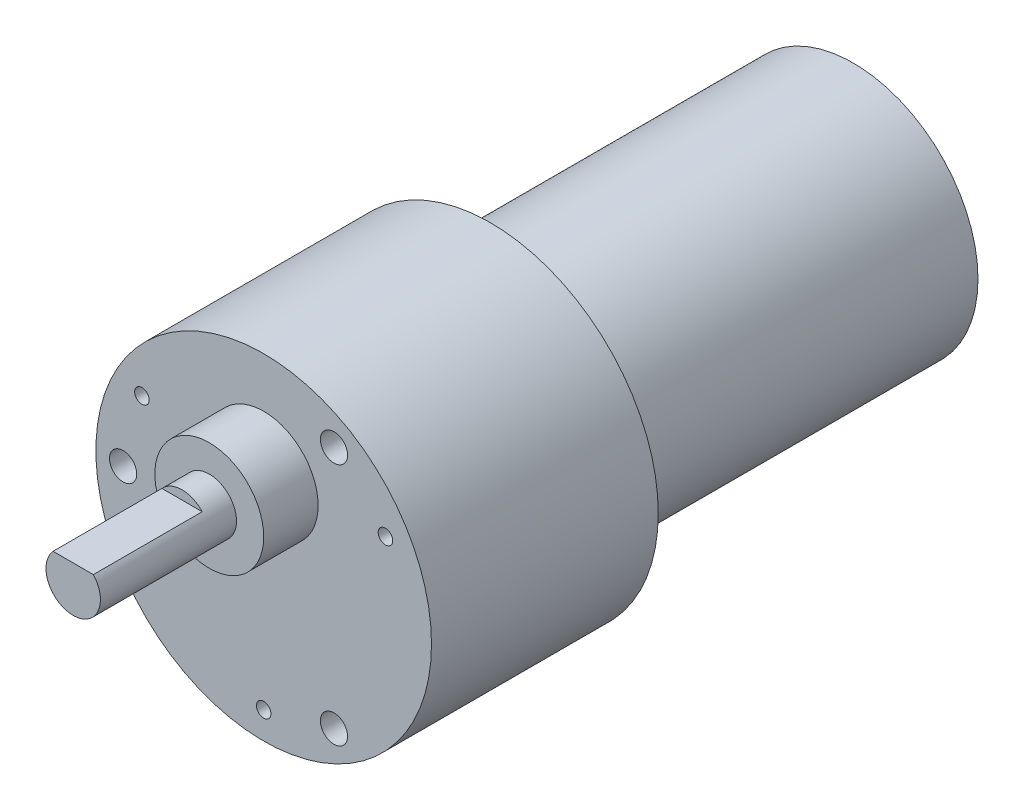
ISO-10303-21;
HEADER;
FILE_DESCRIPTION(('STEP AP214'),'2;1');
FILE_NAME('part.step','',(''),(''),'','','');
FILE_SCHEMA(('AUTOMOTIVE_DESIGN { 1 0 10303 214 1 1 1 1 }'));
ENDSEC;
DATA;
#1=APPLICATION_CONTEXT('core data for automotive mechanical design processes');
#2=APPLICATION_PROTOCOL_DEFINITION('international standard','automotive_design',2000,#1);
#3=PRODUCT_CONTEXT('',#1,'mechanical');
#4=PRODUCT('Part','Part','',(#3));
#5=PRODUCT_RELATED_PRODUCT_CATEGORY('part','',(#4));
#6=PRODUCT_DEFINITION_FORMATION('','',#4);
#7=PRODUCT_DEFINITION_CONTEXT('part definition',#1,'design');
#8=PRODUCT_DEFINITION('design','',#6,#7);
#9=PRODUCT_DEFINITION_SHAPE('','',#8);
#10=(LENGTH_UNIT() NAMED_UNIT(*) SI_UNIT(.MILLI.,.METRE.));
#11=(NAMED_UNIT(*) PLANE_ANGLE_UNIT() SI_UNIT($,.RADIAN.));
#12=(NAMED_UNIT(*) SI_UNIT($,.STERADIAN.) SOLID_ANGLE_UNIT());
#13=UNCERTAINTY_MEASURE_WITH_UNIT(LENGTH_MEASURE(1.E-05),#10,'distance_accuracy_value','');
#14=(GEOMETRIC_REPRESENTATION_CONTEXT(3) GLOBAL_UNCERTAINTY_ASSIGNED_CONTEXT((#13)) GLOBAL_UNIT_ASSIGNED_CONTEXT((#10,
#11,#12)) REPRESENTATION_CONTEXT('',''));
#15=CARTESIAN_POINT('',(0.,0.,0.));
#16=DIRECTION('',(0.,0.,1.));
#17=DIRECTION('',(1.,0.,0.));
#18=AXIS2_PLACEMENT_3D('',#15,#16,#17);
#19=CARTESIAN_POINT('',(0.,0.,0.));
#20=DIRECTION('',(0.,0.,1.));
#21=DIRECTION('',(1.,0.,0.));
#22=AXIS2_PLACEMENT_3D('',#19,#20,#21);
#23=PLANE('',#22);
#24=CARTESIAN_POINT('',(0.,0.,0.));
#25=DIRECTION('',(0.,0.,1.));
#26=DIRECTION('',(1.,0.,0.));
#27=AXIS2_PLACEMENT_3D('',#24,#25,#26);
#28=CIRCLE('',#27,13.75);
#29=CARTESIAN_POINT('',(13.75,0.,0.));
#30=VERTEX_POINT('',#29);
#31=EDGE_CURVE('E147',#30,#30,#28,.T.);
#32=ORIENTED_EDGE('',*,*,#31,.F.);
#33=EDGE_LOOP('',(#32));
#34=FACE_BOUND('',#33,.T.);
#35=CARTESIAN_POINT('',(0.,0.,0.));
#36=DIRECTION('',(0.,0.,1.));
#37=DIRECTION('',(1.,0.,0.));
#38=AXIS2_PLACEMENT_3D('',#35,#36,#37);
#39=CIRCLE('',#38,5.1);
#40=CARTESIAN_POINT('',(5.1,0.,0.));
#41=VERTEX_POINT('',#40);
#42=EDGE_CURVE('E11',#41,#41,#39,.F.);
#43=ORIENTED_EDGE('',*,*,#42,.F.);
#44=EDGE_LOOP('',(#43));
#45=FACE_BOUND('',#44,.T.);
#46=ADVANCED_FACE('F38',(#34,#45),#23,.F.);
#47=CARTESIAN_POINT('',(0.,7.,71.));
#48=DIRECTION('',(0.,0.,1.));
#49=DIRECTION('',(1.,0.,0.));
#50=AXIS2_PLACEMENT_3D('',#47,#48,#49);
#51=PLANE('',#50);
#52=CARTESIAN_POINT('',(0.,7.,71.));
#53=DIRECTION('',(0.,0.,1.));
#54=DIRECTION('',(1.,0.,0.));
#55=AXIS2_PLACEMENT_3D('',#52,#53,#54);
#56=CIRCLE('',#55,6.);
#57=CARTESIAN_POINT('',(6.,7.,71.));
#58=VERTEX_POINT('',#57);
#59=EDGE_CURVE('E138',#58,#58,#56,.T.);
#60=ORIENTED_EDGE('',*,*,#59,.T.);
#61=EDGE_LOOP('',(#60));
#62=FACE_BOUND('',#61,.T.);
#63=CARTESIAN_POINT('',(0.,7.,71.));
#64=DIRECTION('',(0.,0.,1.));
#65=DIRECTION('',(1.,0.,0.));
#66=AXIS2_PLACEMENT_3D('',#63,#64,#65);
#67=CIRCLE('',#66,3.);
#68=CARTESIAN_POINT('',(3.,7.,71.));
#69=VERTEX_POINT('',#68);
#70=EDGE_CURVE('E130',#69,#69,#67,.T.);
#71=ORIENTED_EDGE('',*,*,#70,.F.);
#72=EDGE_LOOP('',(#71));
#73=FACE_BOUND('',#72,.T.);
#74=ADVANCED_FACE('F180',(#62,#73),#51,.T.);
#75=CARTESIAN_POINT('',(0.,0.,65.));
#76=DIRECTION('',(0.,0.,1.));
#77=DIRECTION('',(1.,0.,0.));
#78=AXIS2_PLACEMENT_3D('',#75,#76,#77);
#79=PLANE('',#78);
#80=CARTESIAN_POINT('',(-13.4233937586588,7.75,65.));
#81=DIRECTION('',(0.,0.,1.));
#82=DIRECTION('',(1.,0.,0.));
#83=AXIS2_PLACEMENT_3D('',#80,#81,#82);
#84=CIRCLE('',#83,0.799999999999999);
#85=CARTESIAN_POINT('',(-12.6233937586588,7.75,65.));
#86=VERTEX_POINT('',#85);
#87=EDGE_CURVE('E87',#86,#86,#84,.T.);
#88=ORIENTED_EDGE('',*,*,#87,.F.);
#89=EDGE_LOOP('',(#88));
#90=FACE_BOUND('',#89,.T.);
#91=CARTESIAN_POINT('',(0.,-15.5,65.));
#92=DIRECTION('',(0.,0.,1.));
#93=DIRECTION('',(1.,0.,0.));
#94=AXIS2_PLACEMENT_3D('',#91,#92,#93);
#95=CIRCLE('',#94,0.799999999999999);
#96=CARTESIAN_POINT('',(0.799999999999999,-15.5,65.));
#97=VERTEX_POINT('',#96);
#98=EDGE_CURVE('E86',#97,#97,#95,.T.);
#99=ORIENTED_EDGE('',*,*,#98,.F.);
#100=EDGE_LOOP('',(#99));
#101=FACE_BOUND('',#100,.T.);
#102=CARTESIAN_POINT('',(13.4233937586588,7.75,65.));
#103=DIRECTION('',(0.,0.,1.));
#104=DIRECTION('',(1.,0.,0.));
#105=AXIS2_PLACEMENT_3D('',#102,#103,#104);
#106=CIRCLE('',#105,0.799999999999999);
#107=CARTESIAN_POINT('',(14.2233937586588,7.75,65.));
#108=VERTEX_POINT('',#107);
#109=EDGE_CURVE('E97',#108,#108,#106,.T.);
#110=ORIENTED_EDGE('',*,*,#109,.F.);
#111=EDGE_LOOP('',(#110));
#112=FACE_BOUND('',#111,.T.);
#113=CARTESIAN_POINT('',(7.75000000000006,13.4233937586588,65.));
#114=DIRECTION('',(0.,0.,1.));
#115=DIRECTION('',(1.,0.,0.));
#116=AXIS2_PLACEMENT_3D('',#113,#114,#115);
#117=CIRCLE('',#116,1.5);
#118=CARTESIAN_POINT('',(9.25000000000006,13.4233937586588,65.));
#119=VERTEX_POINT('',#118);
#120=EDGE_CURVE('E106',#119,#119,#117,.T.);
#121=ORIENTED_EDGE('',*,*,#120,.F.);
#122=EDGE_LOOP('',(#121));
#123=FACE_BOUND('',#122,.T.);
#124=CARTESIAN_POINT('',(7.75000000000007,-13.4233937586588,65.));
#125=DIRECTION('',(0.,0.,1.));
#126=DIRECTION('',(1.,0.,0.));
#127=AXIS2_PLACEMENT_3D('',#124,#125,#126);
#128=CIRCLE('',#127,1.5);
#129=CARTESIAN_POINT('',(9.25000000000007,-13.4233937586588,65.));
#130=VERTEX_POINT('',#129);
#131=EDGE_CURVE('E110',#130,#130,#128,.T.);
#132=ORIENTED_EDGE('',*,*,#131,.F.);
#133=EDGE_LOOP('',(#132));
#134=FACE_BOUND('',#133,.T.);
#135=CARTESIAN_POINT('',(-15.5,0.,65.));
#136=DIRECTION('',(0.,0.,1.));
#137=DIRECTION('',(1.,0.,0.));
#138=AXIS2_PLACEMENT_3D('',#135,#136,#137);
#139=CIRCLE('',#138,1.5);
#140=CARTESIAN_POINT('',(-14.,0.,65.));
#141=VERTEX_POINT('',#140);
#142=EDGE_CURVE('E116',#141,#141,#139,.T.);
#143=ORIENTED_EDGE('',*,*,#142,.F.);
#144=EDGE_LOOP('',(#143));
#145=FACE_BOUND('',#144,.T.);
#146=CARTESIAN_POINT('',(0.,0.,65.));
#147=DIRECTION('',(0.,0.,1.));
#148=DIRECTION('',(1.,0.,0.));
#149=AXIS2_PLACEMENT_3D('',#146,#147,#148);
#150=CIRCLE('',#149,18.5);
#151=CARTESIAN_POINT('',(18.5,0.,65.));
#152=VERTEX_POINT('',#151);
#153=EDGE_CURVE('E144',#152,#152,#150,.T.);
#154=ORIENTED_EDGE('',*,*,#153,.T.);
#155=EDGE_LOOP('',(#154));
#156=FACE_BOUND('',#155,.T.);
#157=CARTESIAN_POINT('',(0.,7.,65.));
#158=DIRECTION('',(0.,0.,1.));
#159=DIRECTION('',(1.,0.,0.));
#160=AXIS2_PLACEMENT_3D('',#157,#158,#159);
#161=CIRCLE('',#160,6.);
#162=CARTESIAN_POINT('',(6.,7.,65.));
#163=VERTEX_POINT('',#162);
#164=EDGE_CURVE('E135',#163,#163,#161,.T.);
#165=ORIENTED_EDGE('',*,*,#164,.F.);
#166=EDGE_LOOP('',(#165));
#167=FACE_BOUND('',#166,.T.);
#168=ADVANCED_FACE('F185',(#90,#101,#112,#123,#134,#145,#156,#167),#79,.T.);
#169=CARTESIAN_POINT('',(0.,0.,40.));
#170=DIRECTION('',(0.,0.,-1.));
#171=DIRECTION('',(-1.,0.,0.));
#172=AXIS2_PLACEMENT_3D('',#169,#170,#171);
#173=CYLINDRICAL_SURFACE('',#172,13.75);
#174=CARTESIAN_POINT('',(0.,0.,38.));
#175=DIRECTION('',(0.,0.,1.));
#176=DIRECTION('',(1.,0.,0.));
#177=AXIS2_PLACEMENT_3D('',#174,#175,#176);
#178=CIRCLE('',#177,13.75);
#179=CARTESIAN_POINT('',(13.75,0.,38.));
#180=VERTEX_POINT('',#179);
#181=EDGE_CURVE('E46',#180,#180,#178,.F.);
#182=ORIENTED_EDGE('',*,*,#181,.T.);
#183=EDGE_LOOP('',(#182));
#184=FACE_BOUND('',#183,.T.);
#185=ORIENTED_EDGE('',*,*,#31,.T.);
#186=EDGE_LOOP('',(#185));
#187=FACE_BOUND('',#186,.T.);
#188=ADVANCED_FACE('F157',(#184,#187),#173,.T.);
#189=CARTESIAN_POINT('',(0.,0.,40.));
#190=DIRECTION('',(0.,0.,1.));
#191=DIRECTION('',(1.,0.,0.));
#192=AXIS2_PLACEMENT_3D('',#189,#190,#191);
#193=PLANE('',#192);
#194=CARTESIAN_POINT('',(0.,0.,40.));
#195=DIRECTION('',(0.,0.,1.));
#196=DIRECTION('',(1.,0.,0.));
#197=AXIS2_PLACEMENT_3D('',#194,#195,#196);
#198=CIRCLE('',#197,15.75);
#199=CARTESIAN_POINT('',(15.75,0.,40.));
#200=VERTEX_POINT('',#199);
#201=EDGE_CURVE('E152',#200,#200,#198,.T.);
#202=ORIENTED_EDGE('',*,*,#201,.T.);
#203=EDGE_LOOP('',(#202));
#204=FACE_BOUND('',#203,.T.);
#205=CARTESIAN_POINT('',(0.,0.,40.));
#206=DIRECTION('',(0.,0.,1.));
#207=DIRECTION('',(1.,0.,0.));
#208=AXIS2_PLACEMENT_3D('',#205,#206,#207);
#209=CIRCLE('',#208,18.5);
#210=CARTESIAN_POINT('',(18.5,0.,40.));
#211=VERTEX_POINT('',#210);
#212=EDGE_CURVE('E141',#211,#211,#209,.T.);
#213=ORIENTED_EDGE('',*,*,#212,.F.);
#214=EDGE_LOOP('',(#213));
#215=FACE_BOUND('',#214,.T.);
#216=ADVANCED_FACE('F166',(#204,#215),#193,.F.);
#217=CARTESIAN_POINT('',(0.,0.,65.));
#218=DIRECTION('',(0.,0.,-1.));
#219=DIRECTION('',(-1.,0.,0.));
#220=AXIS2_PLACEMENT_3D('',#217,#218,#219);
#221=CYLINDRICAL_SURFACE('',#220,18.5);
#222=ORIENTED_EDGE('',*,*,#153,.F.);
#223=EDGE_LOOP('',(#222));
#224=FACE_BOUND('',#223,.T.);
#225=ORIENTED_EDGE('',*,*,#212,.T.);
#226=EDGE_LOOP('',(#225));
#227=FACE_BOUND('',#226,.T.);
#228=ADVANCED_FACE('F163',(#224,#227),#221,.T.);
#229=CARTESIAN_POINT('',(0.,0.,40.));
#230=DIRECTION('',(0.,0.,1.));
#231=DIRECTION('',(1.,0.,0.));
#232=AXIS2_PLACEMENT_3D('',#229,#230,#231);
#233=CONICAL_SURFACE('',#232,15.75,0.785398163397453);
#234=ORIENTED_EDGE('',*,*,#181,.F.);
#235=EDGE_LOOP('',(#234));
#236=FACE_BOUND('',#235,.T.);
#237=ORIENTED_EDGE('',*,*,#201,.F.);
#238=EDGE_LOOP('',(#237));
#239=FACE_BOUND('',#238,.T.);
#240=ADVANCED_FACE('F40',(#236,#239),#233,.T.);
#241=CARTESIAN_POINT('',(0.,7.,71.));
#242=DIRECTION('',(0.,0.,-1.));
#243=DIRECTION('',(-1.,0.,0.));
#244=AXIS2_PLACEMENT_3D('',#241,#242,#243);
#245=CYLINDRICAL_SURFACE('',#244,6.);
#246=ORIENTED_EDGE('',*,*,#59,.F.);
#247=EDGE_LOOP('',(#246));
#248=FACE_BOUND('',#247,.T.);
#249=ORIENTED_EDGE('',*,*,#164,.T.);
#250=EDGE_LOOP('',(#249));
#251=FACE_BOUND('',#250,.T.);
#252=ADVANCED_FACE('F162',(#248,#251),#245,.T.);
#253=CARTESIAN_POINT('',(0.,7.,86.));
#254=DIRECTION('',(0.,0.,-1.));
#255=DIRECTION('',(-1.,0.,0.));
#256=AXIS2_PLACEMENT_3D('',#253,#254,#255);
#257=CYLINDRICAL_SURFACE('',#256,3.);
#258=CARTESIAN_POINT('',(0.,7.,86.));
#259=DIRECTION('',(0.,0.,1.));
#260=DIRECTION('',(1.,0.,0.));
#261=AXIS2_PLACEMENT_3D('',#258,#259,#260);
#262=CIRCLE('',#261,3.);
#263=CARTESIAN_POINT('',(-2.22250964833451,9.01505604464491,86.));
#264=VERTEX_POINT('',#263);
#265=CARTESIAN_POINT('',(2.22250964833452,9.01505604464491,86.));
#266=VERTEX_POINT('',#265);
#267=EDGE_CURVE('E132',#264,#266,#262,.T.);
#268=ORIENTED_EDGE('',*,*,#267,.F.);
#269=DIRECTION('',(0.,0.,1.));
#270=VECTOR('',#269,1.);
#271=CARTESIAN_POINT('',(-2.22250964833451,9.01505604464491,74.));
#272=LINE('',#271,#270);
#273=CARTESIAN_POINT('',(-2.22250964833451,9.01505604464491,74.));
#274=VERTEX_POINT('',#273);
#275=EDGE_CURVE('E53',#274,#264,#272,.T.);
#276=ORIENTED_EDGE('',*,*,#275,.F.);
#277=CARTESIAN_POINT('',(0.,7.,74.));
#278=DIRECTION('',(0.,0.,1.));
#279=DIRECTION('',(1.,0.,0.));
#280=AXIS2_PLACEMENT_3D('',#277,#278,#279);
#281=CIRCLE('',#280,3.);
#282=CARTESIAN_POINT('',(2.22250964833452,9.01505604464491,74.));
#283=VERTEX_POINT('',#282);
#284=EDGE_CURVE('E124',#283,#274,#281,.T.);
#285=ORIENTED_EDGE('',*,*,#284,.F.);
#286=DIRECTION('',(0.,0.,1.));
#287=VECTOR('',#286,1.);
#288=CARTESIAN_POINT('',(2.22250964833452,9.01505604464491,74.));
#289=LINE('',#288,#287);
#290=EDGE_CURVE('E59',#283,#266,#289,.T.);
#291=ORIENTED_EDGE('',*,*,#290,.T.);
#292=EDGE_LOOP('',(#268,#276,#285,#291));
#293=FACE_BOUND('',#292,.T.);
#294=ORIENTED_EDGE('',*,*,#70,.T.);
#295=EDGE_LOOP('',(#294));
#296=FACE_BOUND('',#295,.T.);
#297=ADVANCED_FACE('F202',(#293,#296),#257,.T.);
#298=CARTESIAN_POINT('',(0.,7.,86.));
#299=DIRECTION('',(0.,0.,1.));
#300=DIRECTION('',(1.,0.,0.));
#301=AXIS2_PLACEMENT_3D('',#298,#299,#300);
#302=PLANE('',#301);
#303=DIRECTION('',(1.,0.,0.));
#304=VECTOR('',#303,1.);
#305=CARTESIAN_POINT('',(-2.22250964833451,9.01505604464491,86.));
#306=LINE('',#305,#304);
#307=EDGE_CURVE('E66',#264,#266,#306,.T.);
#308=ORIENTED_EDGE('',*,*,#307,.F.);
#309=ORIENTED_EDGE('',*,*,#267,.T.);
#310=EDGE_LOOP('',(#308,#309));
#311=FACE_BOUND('',#310,.T.);
#312=ADVANCED_FACE('F207',(#311),#302,.T.);
#313=CARTESIAN_POINT('',(-2.22250964833451,9.01505604464491,74.));
#314=DIRECTION('',(0.,-1.,0.));
#315=DIRECTION('',(1.,0.,0.));
#316=AXIS2_PLACEMENT_3D('',#313,#314,#315);
#317=PLANE('',#316);
#318=ORIENTED_EDGE('',*,*,#307,.T.);
#319=ORIENTED_EDGE('',*,*,#290,.F.);
#320=DIRECTION('',(1.,0.,0.));
#321=VECTOR('',#320,1.);
#322=CARTESIAN_POINT('',(-2.22250964833451,9.01505604464491,74.));
#323=LINE('',#322,#321);
#324=EDGE_CURVE('E126',#274,#283,#323,.T.);
#325=ORIENTED_EDGE('',*,*,#324,.F.);
#326=ORIENTED_EDGE('',*,*,#275,.T.);
#327=EDGE_LOOP('',(#318,#319,#325,#326));
#328=FACE_BOUND('',#327,.T.);
#329=ADVANCED_FACE('F211',(#328),#317,.F.);
#330=CARTESIAN_POINT('',(0.,7.,74.));
#331=DIRECTION('',(0.,0.,1.));
#332=DIRECTION('',(1.,0.,0.));
#333=AXIS2_PLACEMENT_3D('',#330,#331,#332);
#334=PLANE('',#333);
#335=ORIENTED_EDGE('',*,*,#284,.T.);
#336=ORIENTED_EDGE('',*,*,#324,.T.);
#337=EDGE_LOOP('',(#335,#336));
#338=FACE_BOUND('',#337,.T.);
#339=ADVANCED_FACE('F215',(#338),#334,.T.);
#340=CARTESIAN_POINT('',(-15.5,0.,59.));
#341=DIRECTION('',(0.,0.,1.));
#342=DIRECTION('',(1.,0.,0.));
#343=AXIS2_PLACEMENT_3D('',#340,#341,#342);
#344=CYLINDRICAL_SURFACE('',#343,1.5);
#345=CARTESIAN_POINT('',(-15.5,0.,59.));
#346=DIRECTION('',(0.,0.,1.));
#347=DIRECTION('',(1.,0.,0.));
#348=AXIS2_PLACEMENT_3D('',#345,#346,#347);
#349=CIRCLE('',#348,1.5);
#350=CARTESIAN_POINT('',(-14.,0.,59.));
#351=VERTEX_POINT('',#350);
#352=EDGE_CURVE('E119',#351,#351,#349,.T.);
#353=ORIENTED_EDGE('',*,*,#352,.F.);
#354=EDGE_LOOP('',(#353));
#355=FACE_BOUND('',#354,.T.);
#356=ORIENTED_EDGE('',*,*,#142,.T.);
#357=EDGE_LOOP('',(#356));
#358=FACE_BOUND('',#357,.T.);
#359=ADVANCED_FACE('F218',(#355,#358),#344,.F.);
#360=CARTESIAN_POINT('',(-15.5,0.,59.));
#361=DIRECTION('',(0.,0.,1.));
#362=DIRECTION('',(1.,0.,0.));
#363=AXIS2_PLACEMENT_3D('',#360,#361,#362);
#364=PLANE('',#363);
#365=ORIENTED_EDGE('',*,*,#352,.T.);
#366=EDGE_LOOP('',(#365));
#367=FACE_BOUND('',#366,.T.);
#368=ADVANCED_FACE('F222',(#367),#364,.T.);
#369=CARTESIAN_POINT('',(7.75000000000007,-13.4233937586588,59.));
#370=DIRECTION('',(0.,0.,1.));
#371=DIRECTION('',(1.,0.,0.));
#372=AXIS2_PLACEMENT_3D('',#369,#370,#371);
#373=CYLINDRICAL_SURFACE('',#372,1.5);
#374=CARTESIAN_POINT('',(7.75000000000007,-13.4233937586588,59.));
#375=DIRECTION('',(0.,0.,1.));
#376=DIRECTION('',(1.,0.,0.));
#377=AXIS2_PLACEMENT_3D('',#374,#375,#376);
#378=CIRCLE('',#377,1.5);
#379=CARTESIAN_POINT('',(9.25000000000007,-13.4233937586588,59.));
#380=VERTEX_POINT('',#379);
#381=EDGE_CURVE('E113',#380,#380,#378,.T.);
#382=ORIENTED_EDGE('',*,*,#381,.F.);
#383=EDGE_LOOP('',(#382));
#384=FACE_BOUND('',#383,.T.);
#385=ORIENTED_EDGE('',*,*,#131,.T.);
#386=EDGE_LOOP('',(#385));
#387=FACE_BOUND('',#386,.T.);
#388=ADVANCED_FACE('F226',(#384,#387),#373,.F.);
#389=CARTESIAN_POINT('',(7.75000000000007,-13.4233937586588,59.));
#390=DIRECTION('',(0.,0.,1.));
#391=DIRECTION('',(1.,0.,0.));
#392=AXIS2_PLACEMENT_3D('',#389,#390,#391);
#393=PLANE('',#392);
#394=ORIENTED_EDGE('',*,*,#381,.T.);
#395=EDGE_LOOP('',(#394));
#396=FACE_BOUND('',#395,.T.);
#397=ADVANCED_FACE('F230',(#396),#393,.T.);
#398=CARTESIAN_POINT('',(7.75000000000006,13.4233937586588,59.));
#399=DIRECTION('',(0.,0.,1.));
#400=DIRECTION('',(1.,0.,0.));
#401=AXIS2_PLACEMENT_3D('',#398,#399,#400);
#402=CYLINDRICAL_SURFACE('',#401,1.5);
#403=CARTESIAN_POINT('',(7.75000000000006,13.4233937586588,59.));
#404=DIRECTION('',(0.,0.,1.));
#405=DIRECTION('',(1.,0.,0.));
#406=AXIS2_PLACEMENT_3D('',#403,#404,#405);
#407=CIRCLE('',#406,1.5);
#408=CARTESIAN_POINT('',(9.25000000000006,13.4233937586588,59.));
#409=VERTEX_POINT('',#408);
#410=EDGE_CURVE('E107',#409,#409,#407,.T.);
#411=ORIENTED_EDGE('',*,*,#410,.F.);
#412=EDGE_LOOP('',(#411));
#413=FACE_BOUND('',#412,.T.);
#414=ORIENTED_EDGE('',*,*,#120,.T.);
#415=EDGE_LOOP('',(#414));
#416=FACE_BOUND('',#415,.T.);
#417=ADVANCED_FACE('F234',(#413,#416),#402,.F.);
#418=CARTESIAN_POINT('',(7.75000000000006,13.4233937586588,59.));
#419=DIRECTION('',(0.,0.,1.));
#420=DIRECTION('',(1.,0.,0.));
#421=AXIS2_PLACEMENT_3D('',#418,#419,#420);
#422=PLANE('',#421);
#423=ORIENTED_EDGE('',*,*,#410,.T.);
#424=EDGE_LOOP('',(#423));
#425=FACE_BOUND('',#424,.T.);
#426=ADVANCED_FACE('F238',(#425),#422,.T.);
#427=CARTESIAN_POINT('',(0.,0.,-3.));
#428=DIRECTION('',(0.,0.,1.));
#429=DIRECTION('',(1.,0.,0.));
#430=AXIS2_PLACEMENT_3D('',#427,#428,#429);
#431=CYLINDRICAL_SURFACE('',#430,5.1);
#432=CARTESIAN_POINT('',(0.,0.,-3.));
#433=DIRECTION('',(0.,0.,-1.));
#434=DIRECTION('',(-1.,0.,0.));
#435=AXIS2_PLACEMENT_3D('',#432,#433,#434);
#436=CIRCLE('',#435,5.1);
#437=CARTESIAN_POINT('',(-5.1,0.,-3.));
#438=VERTEX_POINT('',#437);
#439=EDGE_CURVE('E103',#438,#438,#436,.T.);
#440=ORIENTED_EDGE('',*,*,#439,.F.);
#441=EDGE_LOOP('',(#440));
#442=FACE_BOUND('',#441,.T.);
#443=ORIENTED_EDGE('',*,*,#42,.T.);
#444=EDGE_LOOP('',(#443));
#445=FACE_BOUND('',#444,.T.);
#446=ADVANCED_FACE('F242',(#442,#445),#431,.T.);
#447=CARTESIAN_POINT('',(0.,0.,-3.));
#448=DIRECTION('',(0.,0.,-1.));
#449=DIRECTION('',(-1.,0.,0.));
#450=AXIS2_PLACEMENT_3D('',#447,#448,#449);
#451=PLANE('',#450);
#452=ORIENTED_EDGE('',*,*,#439,.T.);
#453=EDGE_LOOP('',(#452));
#454=FACE_BOUND('',#453,.T.);
#455=ADVANCED_FACE('F246',(#454),#451,.T.);
#456=CARTESIAN_POINT('',(13.4233937586588,7.75,59.));
#457=DIRECTION('',(0.,0.,1.));
#458=DIRECTION('',(1.,0.,0.));
#459=AXIS2_PLACEMENT_3D('',#456,#457,#458);
#460=CONICAL_SURFACE('',#459,0.799999999999999,1.02974425867665);
#461=CARTESIAN_POINT('',(13.4233937586588,7.75,58.519311504778));
#462=VERTEX_POINT('',#461);
#463=VERTEX_LOOP('',#462);
#464=FACE_BOUND('',#463,.T.);
#465=CARTESIAN_POINT('',(13.4233937586588,7.75,59.));
#466=DIRECTION('',(0.,0.,1.));
#467=DIRECTION('',(1.,0.,0.));
#468=AXIS2_PLACEMENT_3D('',#465,#466,#467);
#469=CIRCLE('',#468,0.799999999999999);
#470=CARTESIAN_POINT('',(14.2233937586588,7.75,59.));
#471=VERTEX_POINT('',#470);
#472=EDGE_CURVE('E100',#471,#471,#469,.T.);
#473=ORIENTED_EDGE('',*,*,#472,.T.);
#474=EDGE_LOOP('',(#473));
#475=FACE_BOUND('',#474,.T.);
#476=ADVANCED_FACE('F250',(#464,#475),#460,.F.);
#477=CARTESIAN_POINT('',(13.4233937586588,7.75,65.));
#478=DIRECTION('',(0.,0.,1.));
#479=DIRECTION('',(1.,0.,0.));
#480=AXIS2_PLACEMENT_3D('',#477,#478,#479);
#481=CYLINDRICAL_SURFACE('',#480,0.799999999999999);
#482=ORIENTED_EDGE('',*,*,#472,.F.);
#483=EDGE_LOOP('',(#482));
#484=FACE_BOUND('',#483,.T.);
#485=ORIENTED_EDGE('',*,*,#109,.T.);
#486=EDGE_LOOP('',(#485));
#487=FACE_BOUND('',#486,.T.);
#488=ADVANCED_FACE('F254',(#484,#487),#481,.F.);
#489=CARTESIAN_POINT('',(0.,-15.5,59.));
#490=DIRECTION('',(0.,0.,1.));
#491=DIRECTION('',(1.,0.,0.));
#492=AXIS2_PLACEMENT_3D('',#489,#490,#491);
#493=CONICAL_SURFACE('',#492,0.799999999999999,1.02974425867665);
#494=CARTESIAN_POINT('',(0.,-15.5,58.519311504778));
#495=VERTEX_POINT('',#494);
#496=VERTEX_LOOP('',#495);
#497=FACE_BOUND('',#496,.T.);
#498=CARTESIAN_POINT('',(0.,-15.5,59.));
#499=DIRECTION('',(0.,0.,1.));
#500=DIRECTION('',(1.,0.,0.));
#501=AXIS2_PLACEMENT_3D('',#498,#499,#500);
#502=CIRCLE('',#501,0.799999999999999);
#503=CARTESIAN_POINT('',(0.799999999999999,-15.5,59.));
#504=VERTEX_POINT('',#503);
#505=EDGE_CURVE('E90',#504,#504,#502,.T.);
#506=ORIENTED_EDGE('',*,*,#505,.T.);
#507=EDGE_LOOP('',(#506));
#508=FACE_BOUND('',#507,.T.);
#509=ADVANCED_FACE('F257',(#497,#508),#493,.F.);
#510=CARTESIAN_POINT('',(0.,-15.5,65.));
#511=DIRECTION('',(0.,0.,1.));
#512=DIRECTION('',(1.,0.,0.));
#513=AXIS2_PLACEMENT_3D('',#510,#511,#512);
#514=CYLINDRICAL_SURFACE('',#513,0.799999999999999);
#515=ORIENTED_EDGE('',*,*,#505,.F.);
#516=EDGE_LOOP('',(#515));
#517=FACE_BOUND('',#516,.T.);
#518=ORIENTED_EDGE('',*,*,#98,.T.);
#519=EDGE_LOOP('',(#518));
#520=FACE_BOUND('',#519,.T.);
#521=ADVANCED_FACE('F80',(#517,#520),#514,.F.);
#522=CARTESIAN_POINT('',(-13.4233937586588,7.75,59.));
#523=DIRECTION('',(0.,0.,1.));
#524=DIRECTION('',(1.,0.,0.));
#525=AXIS2_PLACEMENT_3D('',#522,#523,#524);
#526=CONICAL_SURFACE('',#525,0.799999999999999,1.02974425867665);
#527=CARTESIAN_POINT('',(-13.4233937586588,7.75,58.519311504778));
#528=VERTEX_POINT('',#527);
#529=VERTEX_LOOP('',#528);
#530=FACE_BOUND('',#529,.T.);
#531=CARTESIAN_POINT('',(-13.4233937586588,7.75,59.));
#532=DIRECTION('',(0.,0.,1.));
#533=DIRECTION('',(1.,0.,0.));
#534=AXIS2_PLACEMENT_3D('',#531,#532,#533);
#535=CIRCLE('',#534,0.799999999999999);
#536=CARTESIAN_POINT('',(-12.6233937586588,7.75,59.));
#537=VERTEX_POINT('',#536);
#538=EDGE_CURVE('E84',#537,#537,#535,.T.);
#539=ORIENTED_EDGE('',*,*,#538,.T.);
#540=EDGE_LOOP('',(#539));
#541=FACE_BOUND('',#540,.T.);
#542=ADVANCED_FACE('F76',(#530,#541),#526,.F.);
#543=CARTESIAN_POINT('',(-13.4233937586588,7.75,65.));
#544=DIRECTION('',(0.,0.,1.));
#545=DIRECTION('',(1.,0.,0.));
#546=AXIS2_PLACEMENT_3D('',#543,#544,#545);
#547=CYLINDRICAL_SURFACE('',#546,0.799999999999999);
#548=ORIENTED_EDGE('',*,*,#538,.F.);
#549=EDGE_LOOP('',(#548));
#550=FACE_BOUND('',#549,.T.);
#551=ORIENTED_EDGE('',*,*,#87,.T.);
#552=EDGE_LOOP('',(#551));
#553=FACE_BOUND('',#552,.T.);
#554=ADVANCED_FACE('F79',(#550,#553),#547,.F.);
#555=CLOSED_SHELL('',(#46,#74,#168,#188,#216,#228,#240,#252,#297,#312,#329,#339,#359,#368,#388,
#397,#417,#426,#446,#455,#476,#488,#509,#521,#542,#554));
#556=MANIFOLD_SOLID_BREP('B2',#555);
#557=ADVANCED_BREP_SHAPE_REPRESENTATION('',(#18,#556),#14);
#558=SHAPE_DEFINITION_REPRESENTATION(#9,#557);
ENDSEC;
END-ISO-10303-21;
